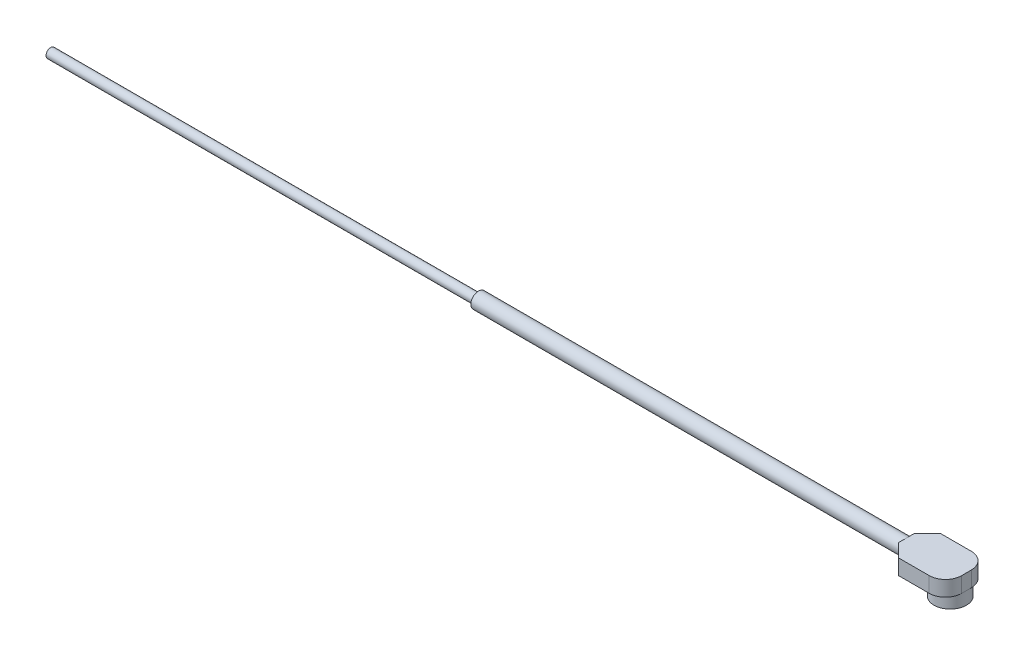
ISO-10303-21;
HEADER;
FILE_DESCRIPTION(('STEP AP214'),'2;1');
FILE_NAME('part.step','',(''),(''),'','','');
FILE_SCHEMA(('AUTOMOTIVE_DESIGN { 1 0 10303 214 1 1 1 1 }'));
ENDSEC;
DATA;
#1=APPLICATION_CONTEXT('core data for automotive mechanical design processes');
#2=APPLICATION_PROTOCOL_DEFINITION('international standard','automotive_design',2000,#1);
#3=PRODUCT_CONTEXT('',#1,'mechanical');
#4=PRODUCT('Part','Part','',(#3));
#5=PRODUCT_RELATED_PRODUCT_CATEGORY('part','',(#4));
#6=PRODUCT_DEFINITION_FORMATION('','',#4);
#7=PRODUCT_DEFINITION_CONTEXT('part definition',#1,'design');
#8=PRODUCT_DEFINITION('design','',#6,#7);
#9=PRODUCT_DEFINITION_SHAPE('','',#8);
#10=(LENGTH_UNIT() NAMED_UNIT(*) SI_UNIT(.MILLI.,.METRE.));
#11=(NAMED_UNIT(*) PLANE_ANGLE_UNIT() SI_UNIT($,.RADIAN.));
#12=(NAMED_UNIT(*) SI_UNIT($,.STERADIAN.) SOLID_ANGLE_UNIT());
#13=UNCERTAINTY_MEASURE_WITH_UNIT(LENGTH_MEASURE(1.E-05),#10,'distance_accuracy_value','');
#14=(GEOMETRIC_REPRESENTATION_CONTEXT(3) GLOBAL_UNCERTAINTY_ASSIGNED_CONTEXT((#13)) GLOBAL_UNIT_ASSIGNED_CONTEXT((#10,
#11,#12)) REPRESENTATION_CONTEXT('',''));
#15=CARTESIAN_POINT('',(0.,0.,0.));
#16=DIRECTION('',(0.,0.,1.));
#17=DIRECTION('',(1.,0.,0.));
#18=AXIS2_PLACEMENT_3D('',#15,#16,#17);
#19=CARTESIAN_POINT('',(-2.25,1.15,1.575));
#20=DIRECTION('',(1.,0.,0.));
#21=DIRECTION('',(0.,0.,-1.));
#22=AXIS2_PLACEMENT_3D('',#19,#20,#21);
#23=PLANE('',#22);
#24=DIRECTION('',(0.,0.,1.));
#25=VECTOR('',#24,1.);
#26=CARTESIAN_POINT('',(-2.25,1.15,1.575));
#27=LINE('',#26,#25);
#28=CARTESIAN_POINT('',(-2.25,1.15,-0.574999999999985));
#29=VERTEX_POINT('',#28);
#30=CARTESIAN_POINT('',(-2.25,1.15,0.));
#31=VERTEX_POINT('',#30);
#32=EDGE_CURVE('E149',#29,#31,#27,.T.);
#33=ORIENTED_EDGE('',*,*,#32,.F.);
#34=DIRECTION('',(0.,-1.,0.));
#35=VECTOR('',#34,1.);
#36=CARTESIAN_POINT('',(-2.25,1.15,-0.574999999999985));
#37=LINE('',#36,#35);
#38=CARTESIAN_POINT('',(-2.25,0.575,-0.574999999999985));
#39=VERTEX_POINT('',#38);
#40=EDGE_CURVE('E78',#29,#39,#37,.T.);
#41=ORIENTED_EDGE('',*,*,#40,.T.);
#42=CARTESIAN_POINT('',(-2.25,0.575,0.));
#43=DIRECTION('',(-1.,0.,0.));
#44=DIRECTION('',(0.,0.,1.));
#45=AXIS2_PLACEMENT_3D('',#42,#43,#44);
#46=CIRCLE('',#45,0.575);
#47=EDGE_CURVE('E165',#31,#39,#46,.T.);
#48=ORIENTED_EDGE('',*,*,#47,.F.);
#49=EDGE_LOOP('',(#33,#41,#48));
#50=FACE_BOUND('',#49,.T.);
#51=ADVANCED_FACE('F70',(#50),#23,.F.);
#52=DIRECTION('',(0.,0.,1.));
#53=VECTOR('',#52,1.);
#54=CARTESIAN_POINT('',(-2.25,0.,1.575));
#55=LINE('',#54,#53);
#56=CARTESIAN_POINT('',(-2.25,0.,0.));
#57=VERTEX_POINT('',#56);
#58=CARTESIAN_POINT('',(-2.25,0.,0.574999999999979));
#59=VERTEX_POINT('',#58);
#60=EDGE_CURVE('E243',#57,#59,#55,.T.);
#61=ORIENTED_EDGE('',*,*,#60,.T.);
#62=DIRECTION('',(0.,1.,0.));
#63=VECTOR('',#62,1.);
#64=CARTESIAN_POINT('',(-2.25,1.15,0.574999999999979));
#65=LINE('',#64,#63);
#66=CARTESIAN_POINT('',(-2.25,0.575,0.574999999999979));
#67=VERTEX_POINT('',#66);
#68=EDGE_CURVE('E247',#59,#67,#65,.T.);
#69=ORIENTED_EDGE('',*,*,#68,.T.);
#70=EDGE_CURVE('E167',#57,#67,#46,.T.);
#71=ORIENTED_EDGE('',*,*,#70,.F.);
#72=EDGE_LOOP('',(#61,#69,#71));
#73=FACE_BOUND('',#72,.T.);
#74=ADVANCED_FACE('F211',(#73),#23,.F.);
#75=EDGE_CURVE('E172',#39,#57,#46,.T.);
#76=ORIENTED_EDGE('',*,*,#75,.F.);
#77=DIRECTION('',(0.,-1.,0.));
#78=VECTOR('',#77,1.);
#79=CARTESIAN_POINT('',(-2.25,1.15,-0.574999999999985));
#80=LINE('',#79,#78);
#81=CARTESIAN_POINT('',(-2.25,0.,-0.574999999999985));
#82=VERTEX_POINT('',#81);
#83=EDGE_CURVE('E85',#39,#82,#80,.T.);
#84=ORIENTED_EDGE('',*,*,#83,.T.);
#85=EDGE_CURVE('E239',#82,#57,#55,.T.);
#86=ORIENTED_EDGE('',*,*,#85,.T.);
#87=EDGE_LOOP('',(#76,#84,#86));
#88=FACE_BOUND('',#87,.T.);
#89=ADVANCED_FACE('F216',(#88),#23,.F.);
#90=CARTESIAN_POINT('',(2.25,1.15,1.575));
#91=DIRECTION('',(-1.,0.,0.));
#92=DIRECTION('',(0.,0.,1.));
#93=AXIS2_PLACEMENT_3D('',#90,#91,#92);
#94=PLANE('',#93);
#95=DIRECTION('',(0.,0.,-1.));
#96=VECTOR('',#95,1.);
#97=CARTESIAN_POINT('',(2.25,0.,1.575));
#98=LINE('',#97,#96);
#99=CARTESIAN_POINT('',(2.25,0.,0.));
#100=VERTEX_POINT('',#99);
#101=CARTESIAN_POINT('',(2.25,0.,-0.36));
#102=VERTEX_POINT('',#101);
#103=EDGE_CURVE('E265',#100,#102,#98,.T.);
#104=ORIENTED_EDGE('',*,*,#103,.T.);
#105=DIRECTION('',(0.,-1.,0.));
#106=VECTOR('',#105,1.);
#107=CARTESIAN_POINT('',(2.25,1.15,-0.36));
#108=LINE('',#107,#106);
#109=CARTESIAN_POINT('',(2.25,1.15,-0.36));
#110=VERTEX_POINT('',#109);
#111=EDGE_CURVE('E281',#102,#110,#108,.F.);
#112=ORIENTED_EDGE('',*,*,#111,.T.);
#113=DIRECTION('',(0.,0.,-1.));
#114=VECTOR('',#113,1.);
#115=CARTESIAN_POINT('',(2.25,1.15,1.575));
#116=LINE('',#115,#114);
#117=CARTESIAN_POINT('',(2.25,1.15,0.36));
#118=VERTEX_POINT('',#117);
#119=EDGE_CURVE('E258',#118,#110,#116,.T.);
#120=ORIENTED_EDGE('',*,*,#119,.F.);
#121=DIRECTION('',(0.,-1.,0.));
#122=VECTOR('',#121,1.);
#123=CARTESIAN_POINT('',(2.25,1.15,0.36));
#124=LINE('',#123,#122);
#125=CARTESIAN_POINT('',(2.25,0.,0.36));
#126=VERTEX_POINT('',#125);
#127=EDGE_CURVE('E278',#118,#126,#124,.T.);
#128=ORIENTED_EDGE('',*,*,#127,.T.);
#129=EDGE_CURVE('E253',#126,#100,#98,.T.);
#130=ORIENTED_EDGE('',*,*,#129,.T.);
#131=EDGE_LOOP('',(#104,#112,#120,#128,#130));
#132=FACE_BOUND('',#131,.T.);
#133=ADVANCED_FACE('F228',(#132),#94,.F.);
#134=CARTESIAN_POINT('',(-2.25,1.15,-1.575));
#135=DIRECTION('',(0.,0.,1.));
#136=DIRECTION('',(1.,0.,0.));
#137=AXIS2_PLACEMENT_3D('',#134,#135,#136);
#138=PLANE('',#137);
#139=DIRECTION('',(-1.,0.,0.));
#140=VECTOR('',#139,1.);
#141=CARTESIAN_POINT('',(-2.25,0.,-1.575));
#142=LINE('',#141,#140);
#143=CARTESIAN_POINT('',(1.035,0.,-1.575));
#144=VERTEX_POINT('',#143);
#145=CARTESIAN_POINT('',(-1.24999999999998,0.,-1.575));
#146=VERTEX_POINT('',#145);
#147=EDGE_CURVE('E251',#144,#146,#142,.T.);
#148=ORIENTED_EDGE('',*,*,#147,.T.);
#149=DIRECTION('',(0.,1.,0.));
#150=VECTOR('',#149,1.);
#151=CARTESIAN_POINT('',(-1.24999999999998,1.15,-1.575));
#152=LINE('',#151,#150);
#153=CARTESIAN_POINT('',(-1.24999999999998,1.15,-1.575));
#154=VERTEX_POINT('',#153);
#155=EDGE_CURVE('E12',#146,#154,#152,.T.);
#156=ORIENTED_EDGE('',*,*,#155,.T.);
#157=DIRECTION('',(-1.,0.,0.));
#158=VECTOR('',#157,1.);
#159=CARTESIAN_POINT('',(-2.25,1.15,-1.575));
#160=LINE('',#159,#158);
#161=CARTESIAN_POINT('',(1.035,1.15,-1.575));
#162=VERTEX_POINT('',#161);
#163=EDGE_CURVE('E175',#162,#154,#160,.T.);
#164=ORIENTED_EDGE('',*,*,#163,.F.);
#165=DIRECTION('',(0.,-1.,0.));
#166=VECTOR('',#165,1.);
#167=CARTESIAN_POINT('',(1.035,1.15,-1.575));
#168=LINE('',#167,#166);
#169=EDGE_CURVE('E185',#162,#144,#168,.T.);
#170=ORIENTED_EDGE('',*,*,#169,.T.);
#171=EDGE_LOOP('',(#148,#156,#164,#170));
#172=FACE_BOUND('',#171,.T.);
#173=ADVANCED_FACE('F222',(#172),#138,.F.);
#174=EDGE_CURVE('E163',#67,#31,#46,.T.);
#175=ORIENTED_EDGE('',*,*,#174,.F.);
#176=DIRECTION('',(0.,1.,0.));
#177=VECTOR('',#176,1.);
#178=CARTESIAN_POINT('',(-2.25,1.15,0.574999999999979));
#179=LINE('',#178,#177);
#180=CARTESIAN_POINT('',(-2.25,1.15,0.574999999999979));
#181=VERTEX_POINT('',#180);
#182=EDGE_CURVE('E174',#67,#181,#179,.T.);
#183=ORIENTED_EDGE('',*,*,#182,.T.);
#184=EDGE_CURVE('E153',#31,#181,#27,.T.);
#185=ORIENTED_EDGE('',*,*,#184,.F.);
#186=EDGE_LOOP('',(#175,#183,#185));
#187=FACE_BOUND('',#186,.T.);
#188=ADVANCED_FACE('F173',(#187),#23,.F.);
#189=CARTESIAN_POINT('',(-2.25,1.15,1.575));
#190=DIRECTION('',(0.,0.,-1.));
#191=DIRECTION('',(-1.,0.,0.));
#192=AXIS2_PLACEMENT_3D('',#189,#190,#191);
#193=PLANE('',#192);
#194=DIRECTION('',(1.,0.,0.));
#195=VECTOR('',#194,1.);
#196=CARTESIAN_POINT('',(-2.25,1.15,1.575));
#197=LINE('',#196,#195);
#198=CARTESIAN_POINT('',(-1.24999999999999,1.15,1.575));
#199=VERTEX_POINT('',#198);
#200=CARTESIAN_POINT('',(1.035,1.15,1.575));
#201=VERTEX_POINT('',#200);
#202=EDGE_CURVE('E157',#199,#201,#197,.T.);
#203=ORIENTED_EDGE('',*,*,#202,.F.);
#204=DIRECTION('',(0.,-1.,0.));
#205=VECTOR('',#204,1.);
#206=CARTESIAN_POINT('',(-1.24999999999999,1.15,1.575));
#207=LINE('',#206,#205);
#208=CARTESIAN_POINT('',(-1.24999999999999,0.,1.575));
#209=VERTEX_POINT('',#208);
#210=EDGE_CURVE('E290',#199,#209,#207,.T.);
#211=ORIENTED_EDGE('',*,*,#210,.T.);
#212=DIRECTION('',(1.,0.,0.));
#213=VECTOR('',#212,1.);
#214=CARTESIAN_POINT('',(-2.25,0.,1.575));
#215=LINE('',#214,#213);
#216=CARTESIAN_POINT('',(1.035,0.,1.575));
#217=VERTEX_POINT('',#216);
#218=EDGE_CURVE('E242',#209,#217,#215,.T.);
#219=ORIENTED_EDGE('',*,*,#218,.T.);
#220=DIRECTION('',(0.,-1.,0.));
#221=VECTOR('',#220,1.);
#222=CARTESIAN_POINT('',(1.035,1.15,1.575));
#223=LINE('',#222,#221);
#224=EDGE_CURVE('E287',#217,#201,#223,.F.);
#225=ORIENTED_EDGE('',*,*,#224,.T.);
#226=EDGE_LOOP('',(#203,#211,#219,#225));
#227=FACE_BOUND('',#226,.T.);
#228=ADVANCED_FACE('F221',(#227),#193,.F.);
#229=CARTESIAN_POINT('',(0.,1.15,0.));
#230=DIRECTION('',(0.,-1.,0.));
#231=DIRECTION('',(0.,0.,-1.));
#232=AXIS2_PLACEMENT_3D('',#229,#230,#231);
#233=PLANE('',#232);
#234=ORIENTED_EDGE('',*,*,#184,.T.);
#235=DIRECTION('',(-0.707106781186545,0.,-0.70710678118655));
#236=VECTOR('',#235,1.);
#237=CARTESIAN_POINT('',(-1.24999999999999,1.15,1.575));
#238=LINE('',#237,#236);
#239=EDGE_CURVE('E299',#181,#199,#238,.F.);
#240=ORIENTED_EDGE('',*,*,#239,.T.);
#241=ORIENTED_EDGE('',*,*,#202,.T.);
#242=CARTESIAN_POINT('',(1.035,1.15,0.36));
#243=DIRECTION('',(0.,-1.,0.));
#244=DIRECTION('',(0.,0.,-1.));
#245=AXIS2_PLACEMENT_3D('',#242,#243,#244);
#246=CIRCLE('',#245,1.215);
#247=EDGE_CURVE('E283',#201,#118,#246,.F.);
#248=ORIENTED_EDGE('',*,*,#247,.T.);
#249=ORIENTED_EDGE('',*,*,#119,.T.);
#250=CARTESIAN_POINT('',(1.035,1.15,-0.36));
#251=DIRECTION('',(0.,-1.,0.));
#252=DIRECTION('',(0.,0.,-1.));
#253=AXIS2_PLACEMENT_3D('',#250,#251,#252);
#254=CIRCLE('',#253,1.215);
#255=EDGE_CURVE('E285',#110,#162,#254,.F.);
#256=ORIENTED_EDGE('',*,*,#255,.T.);
#257=ORIENTED_EDGE('',*,*,#163,.T.);
#258=DIRECTION('',(0.70710678118655,0.,-0.707106781186545));
#259=VECTOR('',#258,1.);
#260=CARTESIAN_POINT('',(-2.25,1.15,-0.574999999999985));
#261=LINE('',#260,#259);
#262=EDGE_CURVE('E93',#154,#29,#261,.F.);
#263=ORIENTED_EDGE('',*,*,#262,.T.);
#264=ORIENTED_EDGE('',*,*,#32,.T.);
#265=EDGE_LOOP('',(#234,#240,#241,#248,#249,#256,#257,#263,#264));
#266=FACE_BOUND('',#265,.T.);
#267=ADVANCED_FACE('F151',(#266),#233,.F.);
#268=CARTESIAN_POINT('',(0.,0.,0.));
#269=DIRECTION('',(0.,-1.,0.));
#270=DIRECTION('',(0.,0.,-1.));
#271=AXIS2_PLACEMENT_3D('',#268,#269,#270);
#272=PLANE('',#271);
#273=ORIENTED_EDGE('',*,*,#218,.F.);
#274=DIRECTION('',(0.707106781186545,0.,0.70710678118655));
#275=VECTOR('',#274,1.);
#276=CARTESIAN_POINT('',(-1.4125,0.,1.41249999999999));
#277=LINE('',#276,#275);
#278=EDGE_CURVE('E250',#209,#59,#277,.F.);
#279=ORIENTED_EDGE('',*,*,#278,.T.);
#280=ORIENTED_EDGE('',*,*,#60,.F.);
#281=ORIENTED_EDGE('',*,*,#85,.F.);
#282=DIRECTION('',(-0.70710678118655,0.,0.707106781186545));
#283=VECTOR('',#282,1.);
#284=CARTESIAN_POINT('',(-1.41249999999998,0.,-1.41249999999999));
#285=LINE('',#284,#283);
#286=EDGE_CURVE('E293',#82,#146,#285,.F.);
#287=ORIENTED_EDGE('',*,*,#286,.T.);
#288=ORIENTED_EDGE('',*,*,#147,.F.);
#289=CARTESIAN_POINT('',(1.035,0.,-0.36));
#290=DIRECTION('',(0.,-1.,0.));
#291=DIRECTION('',(0.,0.,-1.));
#292=AXIS2_PLACEMENT_3D('',#289,#290,#291);
#293=CIRCLE('',#292,1.215);
#294=EDGE_CURVE('E276',#144,#102,#293,.T.);
#295=ORIENTED_EDGE('',*,*,#294,.T.);
#296=ORIENTED_EDGE('',*,*,#103,.F.);
#297=CARTESIAN_POINT('',(1.035,0.,0.));
#298=DIRECTION('',(0.,-1.,0.));
#299=DIRECTION('',(0.,0.,-1.));
#300=AXIS2_PLACEMENT_3D('',#297,#298,#299);
#301=CIRCLE('',#300,1.215);
#302=EDGE_CURVE('E269',#100,#100,#301,.F.);
#303=ORIENTED_EDGE('',*,*,#302,.T.);
#304=ORIENTED_EDGE('',*,*,#129,.F.);
#305=CARTESIAN_POINT('',(1.035,0.,0.36));
#306=DIRECTION('',(0.,-1.,0.));
#307=DIRECTION('',(0.,0.,-1.));
#308=AXIS2_PLACEMENT_3D('',#305,#306,#307);
#309=CIRCLE('',#308,1.215);
#310=EDGE_CURVE('E190',#126,#217,#309,.T.);
#311=ORIENTED_EDGE('',*,*,#310,.T.);
#312=EDGE_LOOP('',(#273,#279,#280,#281,#287,#288,#295,#296,#303,#304,#311));
#313=FACE_BOUND('',#312,.T.);
#314=ADVANCED_FACE('F249',(#313),#272,.T.);
#315=CARTESIAN_POINT('',(1.035,-0.95,0.));
#316=DIRECTION('',(0.,-1.,0.));
#317=DIRECTION('',(0.,0.,-1.));
#318=AXIS2_PLACEMENT_3D('',#315,#316,#317);
#319=PLANE('',#318);
#320=CARTESIAN_POINT('',(1.035,-0.95,0.));
#321=DIRECTION('',(0.,-1.,0.));
#322=DIRECTION('',(0.,0.,-1.));
#323=AXIS2_PLACEMENT_3D('',#320,#321,#322);
#324=CIRCLE('',#323,1.215);
#325=CARTESIAN_POINT('',(1.035,-0.95,-1.215));
#326=VERTEX_POINT('',#325);
#327=EDGE_CURVE('E272',#326,#326,#324,.T.);
#328=ORIENTED_EDGE('',*,*,#327,.T.);
#329=EDGE_LOOP('',(#328));
#330=FACE_BOUND('',#329,.T.);
#331=CARTESIAN_POINT('',(1.035,-0.95,0.));
#332=DIRECTION('',(0.,-1.,0.));
#333=DIRECTION('',(0.,0.,-1.));
#334=AXIS2_PLACEMENT_3D('',#331,#332,#333);
#335=CIRCLE('',#334,1.05);
#336=CARTESIAN_POINT('',(1.035,-0.95,-1.05));
#337=VERTEX_POINT('',#336);
#338=EDGE_CURVE('E179',#337,#337,#335,.T.);
#339=ORIENTED_EDGE('',*,*,#338,.F.);
#340=EDGE_LOOP('',(#339));
#341=FACE_BOUND('',#340,.T.);
#342=ADVANCED_FACE('F341',(#330,#341),#319,.T.);
#343=CARTESIAN_POINT('',(1.035,-0.95,0.));
#344=DIRECTION('',(0.,1.,0.));
#345=DIRECTION('',(0.,0.,1.));
#346=AXIS2_PLACEMENT_3D('',#343,#344,#345);
#347=CYLINDRICAL_SURFACE('',#346,1.215);
#348=ORIENTED_EDGE('',*,*,#302,.F.);
#349=EDGE_LOOP('',(#348));
#350=FACE_BOUND('',#349,.T.);
#351=ORIENTED_EDGE('',*,*,#327,.F.);
#352=EDGE_LOOP('',(#351));
#353=FACE_BOUND('',#352,.T.);
#354=ADVANCED_FACE('F337',(#350,#353),#347,.T.);
#355=CARTESIAN_POINT('',(1.035,-0.95,0.));
#356=DIRECTION('',(0.,1.,0.));
#357=DIRECTION('',(0.,0.,1.));
#358=AXIS2_PLACEMENT_3D('',#355,#356,#357);
#359=CYLINDRICAL_SURFACE('',#358,1.05);
#360=CARTESIAN_POINT('',(1.035,0.,0.));
#361=DIRECTION('',(0.,-1.,0.));
#362=DIRECTION('',(0.,0.,-1.));
#363=AXIS2_PLACEMENT_3D('',#360,#361,#362);
#364=CIRCLE('',#363,1.05);
#365=CARTESIAN_POINT('',(1.035,0.,-1.05));
#366=VERTEX_POINT('',#365);
#367=EDGE_CURVE('E170',#366,#366,#364,.F.);
#368=ORIENTED_EDGE('',*,*,#367,.T.);
#369=EDGE_LOOP('',(#368));
#370=FACE_BOUND('',#369,.T.);
#371=ORIENTED_EDGE('',*,*,#338,.T.);
#372=EDGE_LOOP('',(#371));
#373=FACE_BOUND('',#372,.T.);
#374=ADVANCED_FACE('F340',(#370,#373),#359,.F.);
#375=CARTESIAN_POINT('',(1.035,0.,0.));
#376=DIRECTION('',(0.,-1.,0.));
#377=DIRECTION('',(0.,0.,-1.));
#378=AXIS2_PLACEMENT_3D('',#375,#376,#377);
#379=CIRCLE('',#378,0.25);
#380=CARTESIAN_POINT('',(1.035,0.,-0.25));
#381=VERTEX_POINT('',#380);
#382=EDGE_CURVE('E259',#381,#381,#379,.F.);
#383=ORIENTED_EDGE('',*,*,#382,.F.);
#384=EDGE_LOOP('',(#383));
#385=FACE_BOUND('',#384,.T.);
#386=ADVANCED_FACE('F367',(#385),#272,.T.);
#387=CARTESIAN_POINT('',(1.035,-0.95,0.));
#388=DIRECTION('',(0.,1.,0.));
#389=DIRECTION('',(0.,0.,1.));
#390=AXIS2_PLACEMENT_3D('',#387,#388,#389);
#391=CYLINDRICAL_SURFACE('',#390,0.25);
#392=ORIENTED_EDGE('',*,*,#382,.T.);
#393=EDGE_LOOP('',(#392));
#394=FACE_BOUND('',#393,.T.);
#395=CARTESIAN_POINT('',(1.035,-0.95,0.));
#396=DIRECTION('',(0.,-1.,0.));
#397=DIRECTION('',(0.,0.,-1.));
#398=AXIS2_PLACEMENT_3D('',#395,#396,#397);
#399=CIRCLE('',#398,0.25);
#400=CARTESIAN_POINT('',(1.035,-0.95,-0.25));
#401=VERTEX_POINT('',#400);
#402=EDGE_CURVE('E271',#401,#401,#399,.T.);
#403=ORIENTED_EDGE('',*,*,#402,.T.);
#404=EDGE_LOOP('',(#403));
#405=FACE_BOUND('',#404,.T.);
#406=ADVANCED_FACE('F368',(#394,#405),#391,.F.);
#407=CARTESIAN_POINT('',(1.035,-0.95,0.));
#408=DIRECTION('',(0.,-1.,0.));
#409=DIRECTION('',(0.,0.,-1.));
#410=AXIS2_PLACEMENT_3D('',#407,#408,#409);
#411=PLANE('',#410);
#412=CARTESIAN_POINT('',(1.035,-0.95,0.));
#413=DIRECTION('',(0.,-1.,0.));
#414=DIRECTION('',(0.,0.,-1.));
#415=AXIS2_PLACEMENT_3D('',#412,#413,#414);
#416=CIRCLE('',#415,0.415);
#417=CARTESIAN_POINT('',(1.035,-0.95,-0.415));
#418=VERTEX_POINT('',#417);
#419=EDGE_CURVE('E266',#418,#418,#416,.T.);
#420=ORIENTED_EDGE('',*,*,#419,.T.);
#421=EDGE_LOOP('',(#420));
#422=FACE_BOUND('',#421,.T.);
#423=ORIENTED_EDGE('',*,*,#402,.F.);
#424=EDGE_LOOP('',(#423));
#425=FACE_BOUND('',#424,.T.);
#426=ADVANCED_FACE('F353',(#422,#425),#411,.T.);
#427=CARTESIAN_POINT('',(1.035,-0.95,0.));
#428=DIRECTION('',(0.,1.,0.));
#429=DIRECTION('',(0.,0.,1.));
#430=AXIS2_PLACEMENT_3D('',#427,#428,#429);
#431=CYLINDRICAL_SURFACE('',#430,0.415);
#432=CARTESIAN_POINT('',(1.035,0.,0.));
#433=DIRECTION('',(0.,-1.,0.));
#434=DIRECTION('',(0.,0.,-1.));
#435=AXIS2_PLACEMENT_3D('',#432,#433,#434);
#436=CIRCLE('',#435,0.415);
#437=CARTESIAN_POINT('',(1.035,0.,-0.415));
#438=VERTEX_POINT('',#437);
#439=EDGE_CURVE('E262',#438,#438,#436,.F.);
#440=ORIENTED_EDGE('',*,*,#439,.F.);
#441=EDGE_LOOP('',(#440));
#442=FACE_BOUND('',#441,.T.);
#443=ORIENTED_EDGE('',*,*,#419,.F.);
#444=EDGE_LOOP('',(#443));
#445=FACE_BOUND('',#444,.T.);
#446=ADVANCED_FACE('F356',(#442,#445),#431,.T.);
#447=ORIENTED_EDGE('',*,*,#439,.T.);
#448=EDGE_LOOP('',(#447));
#449=FACE_BOUND('',#448,.T.);
#450=ORIENTED_EDGE('',*,*,#367,.F.);
#451=EDGE_LOOP('',(#450));
#452=FACE_BOUND('',#451,.T.);
#453=ADVANCED_FACE('F358',(#449,#452),#272,.T.);
#454=CARTESIAN_POINT('',(-34.25,0.575,0.));
#455=DIRECTION('',(1.,0.,0.));
#456=DIRECTION('',(0.,0.,-1.));
#457=AXIS2_PLACEMENT_3D('',#454,#455,#456);
#458=CYLINDRICAL_SURFACE('',#457,0.575);
#459=CARTESIAN_POINT('',(-34.25,0.575,0.));
#460=DIRECTION('',(-1.,0.,0.));
#461=DIRECTION('',(0.,0.,1.));
#462=AXIS2_PLACEMENT_3D('',#459,#460,#461);
#463=CIRCLE('',#462,0.575);
#464=CARTESIAN_POINT('',(-34.25,0.575,0.575));
#465=VERTEX_POINT('',#464);
#466=EDGE_CURVE('E177',#465,#465,#463,.T.);
#467=ORIENTED_EDGE('',*,*,#466,.F.);
#468=EDGE_LOOP('',(#467));
#469=FACE_BOUND('',#468,.T.);
#470=ORIENTED_EDGE('',*,*,#47,.T.);
#471=ORIENTED_EDGE('',*,*,#75,.T.);
#472=ORIENTED_EDGE('',*,*,#70,.T.);
#473=ORIENTED_EDGE('',*,*,#174,.T.);
#474=EDGE_LOOP('',(#470,#471,#472,#473));
#475=FACE_BOUND('',#474,.T.);
#476=ADVANCED_FACE('F164',(#469,#475),#458,.T.);
#477=CARTESIAN_POINT('',(-34.25,0.575,0.));
#478=DIRECTION('',(-1.,0.,0.));
#479=DIRECTION('',(0.,0.,1.));
#480=AXIS2_PLACEMENT_3D('',#477,#478,#479);
#481=PLANE('',#480);
#482=CARTESIAN_POINT('',(-34.25,0.575,0.));
#483=DIRECTION('',(-1.,0.,0.));
#484=DIRECTION('',(0.,0.,1.));
#485=AXIS2_PLACEMENT_3D('',#482,#483,#484);
#486=CIRCLE('',#485,0.35);
#487=CARTESIAN_POINT('',(-34.25,0.575,0.35));
#488=VERTEX_POINT('',#487);
#489=EDGE_CURVE('E183',#488,#488,#486,.T.);
#490=ORIENTED_EDGE('',*,*,#489,.F.);
#491=EDGE_LOOP('',(#490));
#492=FACE_BOUND('',#491,.T.);
#493=ORIENTED_EDGE('',*,*,#466,.T.);
#494=EDGE_LOOP('',(#493));
#495=FACE_BOUND('',#494,.T.);
#496=ADVANCED_FACE('F200',(#492,#495),#481,.T.);
#497=CARTESIAN_POINT('',(-66.25,0.575,0.));
#498=DIRECTION('',(1.,0.,0.));
#499=DIRECTION('',(0.,0.,-1.));
#500=AXIS2_PLACEMENT_3D('',#497,#498,#499);
#501=CYLINDRICAL_SURFACE('',#500,0.35);
#502=CARTESIAN_POINT('',(-66.25,0.575,0.));
#503=DIRECTION('',(-1.,0.,0.));
#504=DIRECTION('',(0.,0.,1.));
#505=AXIS2_PLACEMENT_3D('',#502,#503,#504);
#506=CIRCLE('',#505,0.35);
#507=CARTESIAN_POINT('',(-66.25,0.575,0.35));
#508=VERTEX_POINT('',#507);
#509=EDGE_CURVE('E181',#508,#508,#506,.T.);
#510=ORIENTED_EDGE('',*,*,#509,.F.);
#511=EDGE_LOOP('',(#510));
#512=FACE_BOUND('',#511,.T.);
#513=ORIENTED_EDGE('',*,*,#489,.T.);
#514=EDGE_LOOP('',(#513));
#515=FACE_BOUND('',#514,.T.);
#516=ADVANCED_FACE('F198',(#512,#515),#501,.T.);
#517=CARTESIAN_POINT('',(-66.25,0.575,0.));
#518=DIRECTION('',(-1.,0.,0.));
#519=DIRECTION('',(0.,0.,1.));
#520=AXIS2_PLACEMENT_3D('',#517,#518,#519);
#521=PLANE('',#520);
#522=ORIENTED_EDGE('',*,*,#509,.T.);
#523=EDGE_LOOP('',(#522));
#524=FACE_BOUND('',#523,.T.);
#525=ADVANCED_FACE('F196',(#524),#521,.T.);
#526=CARTESIAN_POINT('',(1.035,1.15,-0.36));
#527=DIRECTION('',(0.,-1.,0.));
#528=DIRECTION('',(0.,0.,-1.));
#529=AXIS2_PLACEMENT_3D('',#526,#527,#528);
#530=CYLINDRICAL_SURFACE('',#529,1.215);
#531=ORIENTED_EDGE('',*,*,#255,.F.);
#532=ORIENTED_EDGE('',*,*,#111,.F.);
#533=ORIENTED_EDGE('',*,*,#294,.F.);
#534=ORIENTED_EDGE('',*,*,#169,.F.);
#535=EDGE_LOOP('',(#531,#532,#533,#534));
#536=FACE_BOUND('',#535,.T.);
#537=ADVANCED_FACE('F206',(#536),#530,.T.);
#538=CARTESIAN_POINT('',(1.035,1.15,0.36));
#539=DIRECTION('',(0.,-1.,0.));
#540=DIRECTION('',(0.,0.,-1.));
#541=AXIS2_PLACEMENT_3D('',#538,#539,#540);
#542=CYLINDRICAL_SURFACE('',#541,1.215);
#543=ORIENTED_EDGE('',*,*,#247,.F.);
#544=ORIENTED_EDGE('',*,*,#224,.F.);
#545=ORIENTED_EDGE('',*,*,#310,.F.);
#546=ORIENTED_EDGE('',*,*,#127,.F.);
#547=EDGE_LOOP('',(#543,#544,#545,#546));
#548=FACE_BOUND('',#547,.T.);
#549=ADVANCED_FACE('F309',(#548),#542,.T.);
#550=CARTESIAN_POINT('',(-1.24999999999999,1.15,1.575));
#551=DIRECTION('',(0.70710678118655,0.,-0.707106781186545));
#552=DIRECTION('',(0.,-1.,0.));
#553=AXIS2_PLACEMENT_3D('',#550,#551,#552);
#554=PLANE('',#553);
#555=ORIENTED_EDGE('',*,*,#182,.F.);
#556=ORIENTED_EDGE('',*,*,#68,.F.);
#557=ORIENTED_EDGE('',*,*,#278,.F.);
#558=ORIENTED_EDGE('',*,*,#210,.F.);
#559=ORIENTED_EDGE('',*,*,#239,.F.);
#560=EDGE_LOOP('',(#555,#556,#557,#558,#559));
#561=FACE_BOUND('',#560,.T.);
#562=ADVANCED_FACE('F307',(#561),#554,.F.);
#563=CARTESIAN_POINT('',(-2.25,1.15,-0.574999999999985));
#564=DIRECTION('',(0.707106781186545,0.,0.70710678118655));
#565=DIRECTION('',(0.,-1.,0.));
#566=AXIS2_PLACEMENT_3D('',#563,#564,#565);
#567=PLANE('',#566);
#568=ORIENTED_EDGE('',*,*,#262,.F.);
#569=ORIENTED_EDGE('',*,*,#155,.F.);
#570=ORIENTED_EDGE('',*,*,#286,.F.);
#571=ORIENTED_EDGE('',*,*,#83,.F.);
#572=ORIENTED_EDGE('',*,*,#40,.F.);
#573=EDGE_LOOP('',(#568,#569,#570,#571,#572));
#574=FACE_BOUND('',#573,.T.);
#575=ADVANCED_FACE('F72',(#574),#567,.F.);
#576=CLOSED_SHELL('',(#51,#74,#89,#133,#173,#188,#228,#267,#314,#342,#354,#374,#386,#406,#426,
#446,#453,#476,#496,#516,#525,#537,#549,#562,#575));
#577=MANIFOLD_SOLID_BREP('B2',#576);
#578=ADVANCED_BREP_SHAPE_REPRESENTATION('',(#18,#577),#14);
#579=SHAPE_DEFINITION_REPRESENTATION(#9,#578);
ENDSEC;
END-ISO-10303-21;
